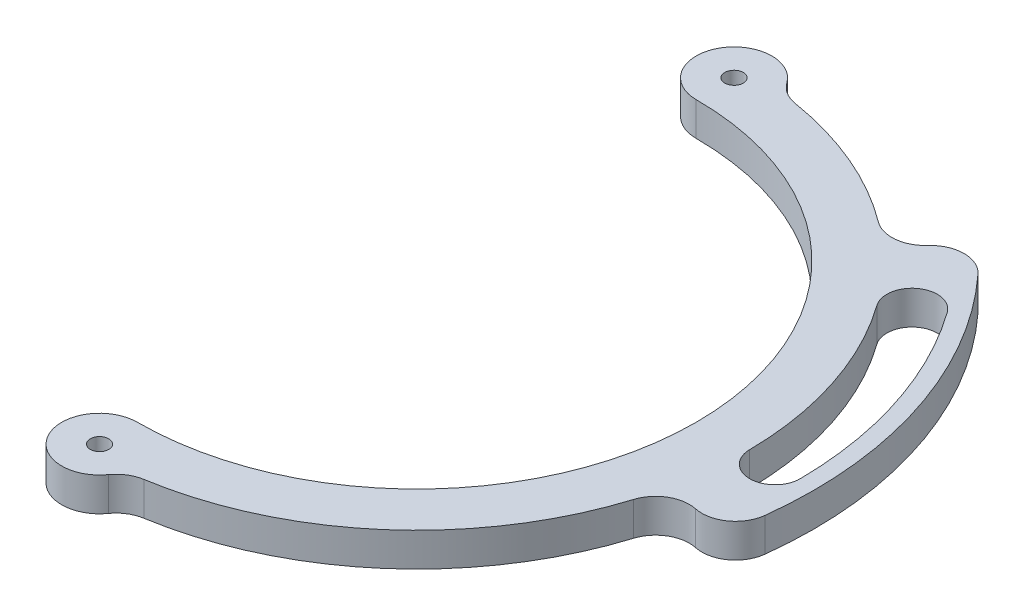
ISO-10303-21;
HEADER;
FILE_DESCRIPTION(('STEP AP214'),'2;1');
FILE_NAME('part.step','',(''),(''),'','','');
FILE_SCHEMA(('AUTOMOTIVE_DESIGN { 1 0 10303 214 1 1 1 1 }'));
ENDSEC;
DATA;
#1=APPLICATION_CONTEXT('core data for automotive mechanical design processes');
#2=APPLICATION_PROTOCOL_DEFINITION('international standard','automotive_design',2000,#1);
#3=PRODUCT_CONTEXT('',#1,'mechanical');
#4=PRODUCT('Part','Part','',(#3));
#5=PRODUCT_RELATED_PRODUCT_CATEGORY('part','',(#4));
#6=PRODUCT_DEFINITION_FORMATION('','',#4);
#7=PRODUCT_DEFINITION_CONTEXT('part definition',#1,'design');
#8=PRODUCT_DEFINITION('design','',#6,#7);
#9=PRODUCT_DEFINITION_SHAPE('','',#8);
#10=(LENGTH_UNIT() NAMED_UNIT(*) SI_UNIT(.MILLI.,.METRE.));
#11=(NAMED_UNIT(*) PLANE_ANGLE_UNIT() SI_UNIT($,.RADIAN.));
#12=(NAMED_UNIT(*) SI_UNIT($,.STERADIAN.) SOLID_ANGLE_UNIT());
#13=UNCERTAINTY_MEASURE_WITH_UNIT(LENGTH_MEASURE(1.E-05),#10,'distance_accuracy_value','');
#14=(GEOMETRIC_REPRESENTATION_CONTEXT(3) GLOBAL_UNCERTAINTY_ASSIGNED_CONTEXT((#13)) GLOBAL_UNIT_ASSIGNED_CONTEXT((#10,
#11,#12)) REPRESENTATION_CONTEXT('',''));
#15=CARTESIAN_POINT('',(0.,0.,0.));
#16=DIRECTION('',(0.,0.,1.));
#17=DIRECTION('',(1.,0.,0.));
#18=AXIS2_PLACEMENT_3D('',#15,#16,#17);
#19=CARTESIAN_POINT('',(0.,5.,0.));
#20=DIRECTION('',(0.,-1.,0.));
#21=DIRECTION('',(0.,0.,-1.));
#22=AXIS2_PLACEMENT_3D('',#19,#20,#21);
#23=CYLINDRICAL_SURFACE('',#22,98.0500000000001);
#24=CARTESIAN_POINT('',(0.,5.,0.));
#25=DIRECTION('',(0.,1.,0.));
#26=DIRECTION('',(0.,0.,1.));
#27=AXIS2_PLACEMENT_3D('',#24,#25,#26);
#28=CIRCLE('',#27,98.0500000000001);
#29=CARTESIAN_POINT('',(15.6870368600538,5.,96.7869793647437));
#30=VERTEX_POINT('',#29);
#31=CARTESIAN_POINT('',(93.6090485831535,5.,29.1744498381173));
#32=VERTEX_POINT('',#31);
#33=EDGE_CURVE('E171',#30,#32,#28,.T.);
#34=ORIENTED_EDGE('',*,*,#33,.F.);
#35=DIRECTION('',(0.,-1.,0.));
#36=VECTOR('',#35,1.);
#37=CARTESIAN_POINT('',(15.6870368600538,5.,96.7869793647437));
#38=LINE('',#37,#36);
#39=CARTESIAN_POINT('',(15.6870368600538,-5.,96.7869793647437));
#40=VERTEX_POINT('',#39);
#41=EDGE_CURVE('E226',#30,#40,#38,.T.);
#42=ORIENTED_EDGE('',*,*,#41,.T.);
#43=CARTESIAN_POINT('',(0.,-5.,0.));
#44=DIRECTION('',(0.,1.,0.));
#45=DIRECTION('',(0.,0.,1.));
#46=AXIS2_PLACEMENT_3D('',#43,#44,#45);
#47=CIRCLE('',#46,98.0500000000001);
#48=CARTESIAN_POINT('',(93.6090485831535,-5.,29.1744498381173));
#49=VERTEX_POINT('',#48);
#50=EDGE_CURVE('E201',#40,#49,#47,.T.);
#51=ORIENTED_EDGE('',*,*,#50,.T.);
#52=DIRECTION('',(0.,-1.,0.));
#53=VECTOR('',#52,1.);
#54=CARTESIAN_POINT('',(93.6090485831535,5.,29.1744498381173));
#55=LINE('',#54,#53);
#56=EDGE_CURVE('E219',#49,#32,#55,.F.);
#57=ORIENTED_EDGE('',*,*,#56,.T.);
#58=EDGE_LOOP('',(#34,#42,#51,#57));
#59=FACE_BOUND('',#58,.T.);
#60=ADVANCED_FACE('F35',(#59),#23,.T.);
#61=CARTESIAN_POINT('',(0.,5.,0.));
#62=DIRECTION('',(0.,-1.,0.));
#63=DIRECTION('',(0.,0.,-1.));
#64=AXIS2_PLACEMENT_3D('',#61,#62,#63);
#65=CYLINDRICAL_SURFACE('',#64,118.05);
#66=CARTESIAN_POINT('',(0.,5.,0.));
#67=DIRECTION('',(0.,1.,0.));
#68=DIRECTION('',(0.,0.,1.));
#69=AXIS2_PLACEMENT_3D('',#66,#67,#68);
#70=CIRCLE('',#69,118.05);
#71=CARTESIAN_POINT('',(86.7710710668279,5.,-80.0411377100266));
#72=VERTEX_POINT('',#71);
#73=CARTESIAN_POINT('',(117.246271435845,5.,13.7518847578128));
#74=VERTEX_POINT('',#73);
#75=EDGE_CURVE('E185',#72,#74,#70,.F.);
#76=ORIENTED_EDGE('',*,*,#75,.T.);
#77=DIRECTION('',(0.,-1.,0.));
#78=VECTOR('',#77,1.);
#79=CARTESIAN_POINT('',(117.246271435845,5.,13.7518847578128));
#80=LINE('',#79,#78);
#81=CARTESIAN_POINT('',(117.246271435845,-5.,13.7518847578128));
#82=VERTEX_POINT('',#81);
#83=EDGE_CURVE('E241',#74,#82,#80,.T.);
#84=ORIENTED_EDGE('',*,*,#83,.T.);
#85=CARTESIAN_POINT('',(0.,-5.,0.));
#86=DIRECTION('',(0.,1.,0.));
#87=DIRECTION('',(0.,0.,1.));
#88=AXIS2_PLACEMENT_3D('',#85,#86,#87);
#89=CIRCLE('',#88,118.05);
#90=CARTESIAN_POINT('',(86.7710710668279,-5.,-80.0411377100266));
#91=VERTEX_POINT('',#90);
#92=EDGE_CURVE('E207',#91,#82,#89,.F.);
#93=ORIENTED_EDGE('',*,*,#92,.F.);
#94=DIRECTION('',(0.,-1.,0.));
#95=VECTOR('',#94,1.);
#96=CARTESIAN_POINT('',(86.7710710668279,5.,-80.0411377100266));
#97=LINE('',#96,#95);
#98=EDGE_CURVE('E239',#91,#72,#97,.F.);
#99=ORIENTED_EDGE('',*,*,#98,.T.);
#100=EDGE_LOOP('',(#76,#84,#93,#99));
#101=FACE_BOUND('',#100,.T.);
#102=ADVANCED_FACE('F280',(#101),#65,.T.);
#103=CARTESIAN_POINT('',(58.582999772449,-5.,-78.6246439588839));
#104=VERTEX_POINT('',#103);
#105=CARTESIAN_POINT('',(15.6870368600538,-5.,-96.7869793647437));
#106=VERTEX_POINT('',#105);
#107=EDGE_CURVE('E200',#104,#106,#47,.T.);
#108=ORIENTED_EDGE('',*,*,#107,.T.);
#109=DIRECTION('',(0.,-1.,0.));
#110=VECTOR('',#109,1.);
#111=CARTESIAN_POINT('',(15.6870368600538,5.,-96.7869793647437));
#112=LINE('',#111,#110);
#113=CARTESIAN_POINT('',(15.6870368600538,5.,-96.7869793647437));
#114=VERTEX_POINT('',#113);
#115=EDGE_CURVE('E237',#106,#114,#112,.F.);
#116=ORIENTED_EDGE('',*,*,#115,.T.);
#117=CARTESIAN_POINT('',(58.582999772449,5.,-78.6246439588839));
#118=VERTEX_POINT('',#117);
#119=EDGE_CURVE('E170',#118,#114,#28,.T.);
#120=ORIENTED_EDGE('',*,*,#119,.F.);
#121=DIRECTION('',(0.,-1.,0.));
#122=VECTOR('',#121,1.);
#123=CARTESIAN_POINT('',(58.582999772449,5.,-78.6246439588839));
#124=LINE('',#123,#122);
#125=EDGE_CURVE('E234',#118,#104,#124,.T.);
#126=ORIENTED_EDGE('',*,*,#125,.T.);
#127=EDGE_LOOP('',(#108,#116,#120,#126));
#128=FACE_BOUND('',#127,.T.);
#129=ADVANCED_FACE('F293',(#128),#23,.T.);
#130=CARTESIAN_POINT('',(0.,5.,-94.3));
#131=DIRECTION('',(0.,-1.,0.));
#132=DIRECTION('',(0.,0.,-1.));
#133=AXIS2_PLACEMENT_3D('',#130,#131,#132);
#134=CYLINDRICAL_SURFACE('',#133,11.25);
#135=CARTESIAN_POINT('',(0.,5.,-94.3));
#136=DIRECTION('',(0.,1.,0.));
#137=DIRECTION('',(0.,0.,1.));
#138=AXIS2_PLACEMENT_3D('',#135,#136,#137);
#139=CIRCLE('',#138,11.25);
#140=CARTESIAN_POINT('',(9.15190868678004,5.,-100.842558168548));
#141=VERTEX_POINT('',#140);
#142=CARTESIAN_POINT('',(0.,5.,-83.05));
#143=VERTEX_POINT('',#142);
#144=EDGE_CURVE('E188',#141,#143,#139,.T.);
#145=ORIENTED_EDGE('',*,*,#144,.F.);
#146=DIRECTION('',(0.,-1.,0.));
#147=VECTOR('',#146,1.);
#148=CARTESIAN_POINT('',(9.15190868678004,5.,-100.842558168548));
#149=LINE('',#148,#147);
#150=CARTESIAN_POINT('',(9.15190868678004,-5.,-100.842558168548));
#151=VERTEX_POINT('',#150);
#152=EDGE_CURVE('E231',#141,#151,#149,.T.);
#153=ORIENTED_EDGE('',*,*,#152,.T.);
#154=CARTESIAN_POINT('',(0.,-5.,-94.3));
#155=DIRECTION('',(0.,1.,0.));
#156=DIRECTION('',(0.,0.,1.));
#157=AXIS2_PLACEMENT_3D('',#154,#155,#156);
#158=CIRCLE('',#157,11.25);
#159=CARTESIAN_POINT('',(0.,-5.,-83.05));
#160=VERTEX_POINT('',#159);
#161=EDGE_CURVE('E210',#151,#160,#158,.T.);
#162=ORIENTED_EDGE('',*,*,#161,.T.);
#163=DIRECTION('',(0.,-1.,0.));
#164=VECTOR('',#163,1.);
#165=CARTESIAN_POINT('',(0.,5.,-83.05));
#166=LINE('',#165,#164);
#167=EDGE_CURVE('E216',#143,#160,#166,.T.);
#168=ORIENTED_EDGE('',*,*,#167,.F.);
#169=EDGE_LOOP('',(#145,#153,#162,#168));
#170=FACE_BOUND('',#169,.T.);
#171=ADVANCED_FACE('F320',(#170),#134,.T.);
#172=CARTESIAN_POINT('',(0.,5.,0.));
#173=DIRECTION('',(0.,-1.,0.));
#174=DIRECTION('',(0.,0.,-1.));
#175=AXIS2_PLACEMENT_3D('',#172,#173,#174);
#176=CYLINDRICAL_SURFACE('',#175,83.05);
#177=CARTESIAN_POINT('',(0.,-5.,0.));
#178=DIRECTION('',(0.,1.,0.));
#179=DIRECTION('',(0.,0.,1.));
#180=AXIS2_PLACEMENT_3D('',#177,#178,#179);
#181=CIRCLE('',#180,83.05);
#182=CARTESIAN_POINT('',(0.,-5.,83.05));
#183=VERTEX_POINT('',#182);
#184=EDGE_CURVE('E177',#183,#160,#181,.T.);
#185=ORIENTED_EDGE('',*,*,#184,.F.);
#186=DIRECTION('',(0.,-1.,0.));
#187=VECTOR('',#186,1.);
#188=CARTESIAN_POINT('',(0.,5.,83.05));
#189=LINE('',#188,#187);
#190=CARTESIAN_POINT('',(0.,5.,83.05));
#191=VERTEX_POINT('',#190);
#192=EDGE_CURVE('E159',#191,#183,#189,.T.);
#193=ORIENTED_EDGE('',*,*,#192,.F.);
#194=CARTESIAN_POINT('',(0.,5.,0.));
#195=DIRECTION('',(0.,1.,0.));
#196=DIRECTION('',(0.,0.,1.));
#197=AXIS2_PLACEMENT_3D('',#194,#195,#196);
#198=CIRCLE('',#197,83.05);
#199=EDGE_CURVE('E190',#191,#143,#198,.T.);
#200=ORIENTED_EDGE('',*,*,#199,.T.);
#201=ORIENTED_EDGE('',*,*,#167,.T.);
#202=EDGE_LOOP('',(#185,#193,#200,#201));
#203=FACE_BOUND('',#202,.T.);
#204=ADVANCED_FACE('F315',(#203),#176,.F.);
#205=CARTESIAN_POINT('',(105.545980979423,5.,-0.921085821854197));
#206=DIRECTION('',(0.,-1.,0.));
#207=DIRECTION('',(0.,0.,-1.));
#208=AXIS2_PLACEMENT_3D('',#205,#206,#207);
#209=CYLINDRICAL_SURFACE('',#208,7.50000000000003);
#210=CARTESIAN_POINT('',(105.545980979423,-5.,-0.921085821854197));
#211=DIRECTION('',(0.,1.,0.));
#212=DIRECTION('',(0.,0.,1.));
#213=AXIS2_PLACEMENT_3D('',#210,#211,#212);
#214=CIRCLE('',#213,7.50000000000003);
#215=CARTESIAN_POINT('',(98.046266556442,-5.,-0.855636805616287));
#216=VERTEX_POINT('',#215);
#217=CARTESIAN_POINT('',(113.045695402405,-5.,-0.986534838092041));
#218=VERTEX_POINT('',#217);
#219=EDGE_CURVE('E155',#216,#218,#214,.T.);
#220=ORIENTED_EDGE('',*,*,#219,.F.);
#221=DIRECTION('',(0.,-1.,0.));
#222=VECTOR('',#221,1.);
#223=CARTESIAN_POINT('',(98.046266556442,5.,-0.855636805616287));
#224=LINE('',#223,#222);
#225=CARTESIAN_POINT('',(98.046266556442,5.,-0.855636805616287));
#226=VERTEX_POINT('',#225);
#227=EDGE_CURVE('E148',#226,#216,#224,.T.);
#228=ORIENTED_EDGE('',*,*,#227,.F.);
#229=CARTESIAN_POINT('',(105.545980979423,5.,-0.921085821854197));
#230=DIRECTION('',(0.,1.,0.));
#231=DIRECTION('',(0.,0.,1.));
#232=AXIS2_PLACEMENT_3D('',#229,#230,#231);
#233=CIRCLE('',#232,7.50000000000003);
#234=CARTESIAN_POINT('',(113.045695402405,5.,-0.986534838092041));
#235=VERTEX_POINT('',#234);
#236=EDGE_CURVE('E152',#226,#235,#233,.T.);
#237=ORIENTED_EDGE('',*,*,#236,.T.);
#238=DIRECTION('',(0.,-1.,0.));
#239=VECTOR('',#238,1.);
#240=CARTESIAN_POINT('',(113.045695402405,5.,-0.986534838092041));
#241=LINE('',#240,#239);
#242=EDGE_CURVE('E195',#235,#218,#241,.T.);
#243=ORIENTED_EDGE('',*,*,#242,.T.);
#244=EDGE_LOOP('',(#220,#228,#237,#243));
#245=FACE_BOUND('',#244,.T.);
#246=ADVANCED_FACE('F150',(#245),#209,.F.);
#247=CARTESIAN_POINT('',(79.8240265748373,-5.,-56.9379248074574));
#248=VERTEX_POINT('',#247);
#249=EDGE_CURVE('E197',#216,#248,#47,.T.);
#250=ORIENTED_EDGE('',*,*,#249,.T.);
#251=DIRECTION('',(0.,-1.,0.));
#252=VECTOR('',#251,1.);
#253=CARTESIAN_POINT('',(79.8240265748373,5.,-56.9379248074574));
#254=LINE('',#253,#252);
#255=CARTESIAN_POINT('',(79.8240265748373,5.,-56.9379248074574));
#256=VERTEX_POINT('',#255);
#257=EDGE_CURVE('E160',#256,#248,#254,.T.);
#258=ORIENTED_EDGE('',*,*,#257,.F.);
#259=EDGE_CURVE('E163',#226,#256,#28,.T.);
#260=ORIENTED_EDGE('',*,*,#259,.F.);
#261=ORIENTED_EDGE('',*,*,#227,.T.);
#262=EDGE_LOOP('',(#250,#258,#260,#261));
#263=FACE_BOUND('',#262,.T.);
#264=ADVANCED_FACE('F164',(#263),#23,.T.);
#265=CARTESIAN_POINT('',(85.9298929625094,5.,-61.2931969752892));
#266=DIRECTION('',(0.,-1.,0.));
#267=DIRECTION('',(0.,0.,-1.));
#268=AXIS2_PLACEMENT_3D('',#265,#266,#267);
#269=CYLINDRICAL_SURFACE('',#268,7.50000000000003);
#270=CARTESIAN_POINT('',(85.9298929625094,-5.,-61.2931969752892));
#271=DIRECTION('',(0.,1.,0.));
#272=DIRECTION('',(0.,0.,1.));
#273=AXIS2_PLACEMENT_3D('',#270,#271,#272);
#274=CIRCLE('',#273,7.50000000000003);
#275=CARTESIAN_POINT('',(92.0357593501821,-5.,-65.6484691431214));
#276=VERTEX_POINT('',#275);
#277=EDGE_CURVE('E199',#276,#248,#274,.T.);
#278=ORIENTED_EDGE('',*,*,#277,.F.);
#279=DIRECTION('',(0.,-1.,0.));
#280=VECTOR('',#279,1.);
#281=CARTESIAN_POINT('',(92.0357593501821,5.,-65.6484691431214));
#282=LINE('',#281,#280);
#283=CARTESIAN_POINT('',(92.0357593501821,5.,-65.6484691431214));
#284=VERTEX_POINT('',#283);
#285=EDGE_CURVE('E221',#284,#276,#282,.T.);
#286=ORIENTED_EDGE('',*,*,#285,.F.);
#287=CARTESIAN_POINT('',(85.9298929625094,5.,-61.2931969752892));
#288=DIRECTION('',(0.,1.,0.));
#289=DIRECTION('',(0.,0.,1.));
#290=AXIS2_PLACEMENT_3D('',#287,#288,#289);
#291=CIRCLE('',#290,7.50000000000003);
#292=EDGE_CURVE('E168',#284,#256,#291,.T.);
#293=ORIENTED_EDGE('',*,*,#292,.T.);
#294=ORIENTED_EDGE('',*,*,#257,.T.);
#295=EDGE_LOOP('',(#278,#286,#293,#294));
#296=FACE_BOUND('',#295,.T.);
#297=ADVANCED_FACE('F343',(#296),#269,.F.);
#298=CARTESIAN_POINT('',(-2.4980018054066E-13,5.,2.22044604925031E-13));
#299=DIRECTION('',(0.,-1.,0.));
#300=DIRECTION('',(0.,0.,-1.));
#301=AXIS2_PLACEMENT_3D('',#298,#299,#300);
#302=CYLINDRICAL_SURFACE('',#301,113.05);
#303=CARTESIAN_POINT('',(-2.4980018054066E-13,-5.,2.22044604925031E-13));
#304=DIRECTION('',(0.,1.,0.));
#305=DIRECTION('',(0.,0.,1.));
#306=AXIS2_PLACEMENT_3D('',#303,#304,#305);
#307=CIRCLE('',#306,113.05);
#308=EDGE_CURVE('E204',#218,#276,#307,.T.);
#309=ORIENTED_EDGE('',*,*,#308,.F.);
#310=ORIENTED_EDGE('',*,*,#242,.F.);
#311=CARTESIAN_POINT('',(-2.4980018054066E-13,5.,2.22044604925031E-13));
#312=DIRECTION('',(0.,1.,0.));
#313=DIRECTION('',(0.,0.,1.));
#314=AXIS2_PLACEMENT_3D('',#311,#312,#313);
#315=CIRCLE('',#314,113.05);
#316=EDGE_CURVE('E174',#235,#284,#315,.T.);
#317=ORIENTED_EDGE('',*,*,#316,.T.);
#318=ORIENTED_EDGE('',*,*,#285,.T.);
#319=EDGE_LOOP('',(#309,#310,#317,#318));
#320=FACE_BOUND('',#319,.T.);
#321=ADVANCED_FACE('F348',(#320),#302,.F.);
#322=CARTESIAN_POINT('',(0.,5.,94.3));
#323=DIRECTION('',(0.,-1.,0.));
#324=DIRECTION('',(0.,0.,-1.));
#325=AXIS2_PLACEMENT_3D('',#322,#323,#324);
#326=CYLINDRICAL_SURFACE('',#325,11.25);
#327=CARTESIAN_POINT('',(0.,-5.,94.3));
#328=DIRECTION('',(0.,1.,0.));
#329=DIRECTION('',(0.,0.,1.));
#330=AXIS2_PLACEMENT_3D('',#327,#328,#329);
#331=CIRCLE('',#330,11.25);
#332=CARTESIAN_POINT('',(9.15190868678003,-5.,100.842558168548));
#333=VERTEX_POINT('',#332);
#334=EDGE_CURVE('E175',#333,#183,#331,.F.);
#335=ORIENTED_EDGE('',*,*,#334,.F.);
#336=DIRECTION('',(0.,-1.,0.));
#337=VECTOR('',#336,1.);
#338=CARTESIAN_POINT('',(9.15190868678003,5.,100.842558168548));
#339=LINE('',#338,#337);
#340=CARTESIAN_POINT('',(9.15190868678003,5.,100.842558168548));
#341=VERTEX_POINT('',#340);
#342=EDGE_CURVE('E229',#333,#341,#339,.F.);
#343=ORIENTED_EDGE('',*,*,#342,.T.);
#344=CARTESIAN_POINT('',(0.,5.,94.3));
#345=DIRECTION('',(0.,1.,0.));
#346=DIRECTION('',(0.,0.,1.));
#347=AXIS2_PLACEMENT_3D('',#344,#345,#346);
#348=CIRCLE('',#347,11.25);
#349=EDGE_CURVE('E193',#341,#191,#348,.F.);
#350=ORIENTED_EDGE('',*,*,#349,.T.);
#351=ORIENTED_EDGE('',*,*,#192,.T.);
#352=EDGE_LOOP('',(#335,#343,#350,#351));
#353=FACE_BOUND('',#352,.T.);
#354=ADVANCED_FACE('F310',(#353),#326,.T.);
#355=CARTESIAN_POINT('',(0.,5.,0.));
#356=DIRECTION('',(0.,1.,0.));
#357=DIRECTION('',(0.,0.,1.));
#358=AXIS2_PLACEMENT_3D('',#355,#356,#357);
#359=PLANE('',#358);
#360=CARTESIAN_POINT('',(0.,5.,94.2999999999999));
#361=DIRECTION('',(0.,1.,0.));
#362=DIRECTION('',(0.,0.,1.));
#363=AXIS2_PLACEMENT_3D('',#360,#361,#362);
#364=CIRCLE('',#363,2.74999999999999);
#365=CARTESIAN_POINT('',(0.,5.,97.0499999999999));
#366=VERTEX_POINT('',#365);
#367=EDGE_CURVE('E264',#366,#366,#364,.T.);
#368=ORIENTED_EDGE('',*,*,#367,.F.);
#369=EDGE_LOOP('',(#368));
#370=FACE_BOUND('',#369,.T.);
#371=CARTESIAN_POINT('',(0.,5.,-94.3));
#372=DIRECTION('',(0.,1.,0.));
#373=DIRECTION('',(0.,0.,1.));
#374=AXIS2_PLACEMENT_3D('',#371,#372,#373);
#375=CIRCLE('',#374,2.74999999999999);
#376=CARTESIAN_POINT('',(0.,5.,-91.55));
#377=VERTEX_POINT('',#376);
#378=EDGE_CURVE('E536',#377,#377,#375,.T.);
#379=ORIENTED_EDGE('',*,*,#378,.F.);
#380=EDGE_LOOP('',(#379));
#381=FACE_BOUND('',#380,.T.);
#382=ORIENTED_EDGE('',*,*,#236,.F.);
#383=ORIENTED_EDGE('',*,*,#259,.T.);
#384=ORIENTED_EDGE('',*,*,#292,.F.);
#385=ORIENTED_EDGE('',*,*,#316,.F.);
#386=EDGE_LOOP('',(#382,#383,#384,#385));
#387=FACE_BOUND('',#386,.T.);
#388=ORIENTED_EDGE('',*,*,#33,.T.);
#389=CARTESIAN_POINT('',(103.15612136063,5.,32.1499164202812));
#390=DIRECTION('',(0.,1.,0.));
#391=DIRECTION('',(0.,0.,1.));
#392=AXIS2_PLACEMENT_3D('',#389,#390,#391);
#393=CIRCLE('',#392,10.);
#394=CARTESIAN_POINT('',(105.235238268807,5.,22.3684404129431));
#395=VERTEX_POINT('',#394);
#396=EDGE_CURVE('E11',#32,#395,#393,.F.);
#397=ORIENTED_EDGE('',*,*,#396,.T.);
#398=CARTESIAN_POINT('',(107.314355176984,5.,12.586964405605));
#399=DIRECTION('',(0.,1.,0.));
#400=DIRECTION('',(0.,0.,1.));
#401=AXIS2_PLACEMENT_3D('',#398,#399,#400);
#402=CIRCLE('',#401,10.);
#403=EDGE_CURVE('E248',#395,#74,#402,.T.);
#404=ORIENTED_EDGE('',*,*,#403,.T.);
#405=ORIENTED_EDGE('',*,*,#75,.F.);
#406=CARTESIAN_POINT('',(79.4207050298242,5.,-73.2608634440353));
#407=DIRECTION('',(0.,1.,0.));
#408=DIRECTION('',(0.,0.,1.));
#409=AXIS2_PLACEMENT_3D('',#406,#407,#408);
#410=CIRCLE('',#409,10.);
#411=CARTESIAN_POINT('',(71.9892567750503,5.,-79.9521695076239));
#412=VERTEX_POINT('',#411);
#413=EDGE_CURVE('E52',#72,#412,#410,.T.);
#414=ORIENTED_EDGE('',*,*,#413,.T.);
#415=CARTESIAN_POINT('',(64.5578085202765,5.,-86.6434755712127));
#416=DIRECTION('',(0.,1.,0.));
#417=DIRECTION('',(0.,0.,1.));
#418=AXIS2_PLACEMENT_3D('',#415,#416,#417);
#419=CIRCLE('',#418,10.);
#420=EDGE_CURVE('E260',#412,#118,#419,.F.);
#421=ORIENTED_EDGE('',*,*,#420,.T.);
#422=ORIENTED_EDGE('',*,*,#119,.T.);
#423=CARTESIAN_POINT('',(17.2869386305845,5.,-106.65816542948));
#424=DIRECTION('',(0.,1.,0.));
#425=DIRECTION('',(0.,0.,1.));
#426=AXIS2_PLACEMENT_3D('',#423,#424,#425);
#427=CIRCLE('',#426,10.);
#428=EDGE_CURVE('E256',#114,#141,#427,.F.);
#429=ORIENTED_EDGE('',*,*,#428,.T.);
#430=ORIENTED_EDGE('',*,*,#144,.T.);
#431=ORIENTED_EDGE('',*,*,#199,.F.);
#432=ORIENTED_EDGE('',*,*,#349,.F.);
#433=CARTESIAN_POINT('',(17.2869386305845,5.,106.65816542948));
#434=DIRECTION('',(0.,1.,0.));
#435=DIRECTION('',(0.,0.,1.));
#436=AXIS2_PLACEMENT_3D('',#433,#434,#435);
#437=CIRCLE('',#436,10.);
#438=EDGE_CURVE('E252',#341,#30,#437,.F.);
#439=ORIENTED_EDGE('',*,*,#438,.T.);
#440=EDGE_LOOP('',(#388,#397,#404,#405,#414,#421,#422,#429,#430,#431,#432,#439));
#441=FACE_BOUND('',#440,.T.);
#442=ADVANCED_FACE('F172',(#370,#381,#387,#441),#359,.T.);
#443=CARTESIAN_POINT('',(0.,-5.,0.));
#444=DIRECTION('',(0.,1.,0.));
#445=DIRECTION('',(0.,0.,1.));
#446=AXIS2_PLACEMENT_3D('',#443,#444,#445);
#447=PLANE('',#446);
#448=CARTESIAN_POINT('',(0.,-5.,94.2999999999999));
#449=DIRECTION('',(0.,1.,0.));
#450=DIRECTION('',(0.,0.,1.));
#451=AXIS2_PLACEMENT_3D('',#448,#449,#450);
#452=CIRCLE('',#451,2.75);
#453=CARTESIAN_POINT('',(0.,-5.,97.0499999999999));
#454=VERTEX_POINT('',#453);
#455=EDGE_CURVE('E268',#454,#454,#452,.T.);
#456=ORIENTED_EDGE('',*,*,#455,.T.);
#457=EDGE_LOOP('',(#456));
#458=FACE_BOUND('',#457,.T.);
#459=CARTESIAN_POINT('',(0.,-5.,-94.3));
#460=DIRECTION('',(0.,1.,0.));
#461=DIRECTION('',(0.,0.,1.));
#462=AXIS2_PLACEMENT_3D('',#459,#460,#461);
#463=CIRCLE('',#462,2.75);
#464=CARTESIAN_POINT('',(0.,-5.,-91.55));
#465=VERTEX_POINT('',#464);
#466=EDGE_CURVE('E180',#465,#465,#463,.T.);
#467=ORIENTED_EDGE('',*,*,#466,.T.);
#468=EDGE_LOOP('',(#467));
#469=FACE_BOUND('',#468,.T.);
#470=ORIENTED_EDGE('',*,*,#219,.T.);
#471=ORIENTED_EDGE('',*,*,#308,.T.);
#472=ORIENTED_EDGE('',*,*,#277,.T.);
#473=ORIENTED_EDGE('',*,*,#249,.F.);
#474=EDGE_LOOP('',(#470,#471,#472,#473));
#475=FACE_BOUND('',#474,.T.);
#476=ORIENTED_EDGE('',*,*,#92,.T.);
#477=CARTESIAN_POINT('',(107.314355176984,-5.,12.586964405605));
#478=DIRECTION('',(0.,1.,0.));
#479=DIRECTION('',(0.,0.,1.));
#480=AXIS2_PLACEMENT_3D('',#477,#478,#479);
#481=CIRCLE('',#480,10.);
#482=CARTESIAN_POINT('',(105.235238268807,-5.,22.3684404129431));
#483=VERTEX_POINT('',#482);
#484=EDGE_CURVE('E245',#82,#483,#481,.F.);
#485=ORIENTED_EDGE('',*,*,#484,.T.);
#486=CARTESIAN_POINT('',(103.15612136063,-5.,32.1499164202812));
#487=DIRECTION('',(0.,1.,0.));
#488=DIRECTION('',(0.,0.,1.));
#489=AXIS2_PLACEMENT_3D('',#486,#487,#488);
#490=CIRCLE('',#489,10.);
#491=EDGE_CURVE('E44',#483,#49,#490,.T.);
#492=ORIENTED_EDGE('',*,*,#491,.T.);
#493=ORIENTED_EDGE('',*,*,#50,.F.);
#494=CARTESIAN_POINT('',(17.2869386305845,-5.,106.65816542948));
#495=DIRECTION('',(0.,1.,0.));
#496=DIRECTION('',(0.,0.,1.));
#497=AXIS2_PLACEMENT_3D('',#494,#495,#496);
#498=CIRCLE('',#497,10.);
#499=EDGE_CURVE('E250',#40,#333,#498,.T.);
#500=ORIENTED_EDGE('',*,*,#499,.T.);
#501=ORIENTED_EDGE('',*,*,#334,.T.);
#502=ORIENTED_EDGE('',*,*,#184,.T.);
#503=ORIENTED_EDGE('',*,*,#161,.F.);
#504=CARTESIAN_POINT('',(17.2869386305845,-5.,-106.65816542948));
#505=DIRECTION('',(0.,1.,0.));
#506=DIRECTION('',(0.,0.,1.));
#507=AXIS2_PLACEMENT_3D('',#504,#505,#506);
#508=CIRCLE('',#507,10.);
#509=EDGE_CURVE('E254',#151,#106,#508,.T.);
#510=ORIENTED_EDGE('',*,*,#509,.T.);
#511=ORIENTED_EDGE('',*,*,#107,.F.);
#512=CARTESIAN_POINT('',(64.5578085202765,-5.,-86.6434755712127));
#513=DIRECTION('',(0.,1.,0.));
#514=DIRECTION('',(0.,0.,1.));
#515=AXIS2_PLACEMENT_3D('',#512,#513,#514);
#516=CIRCLE('',#515,10.);
#517=CARTESIAN_POINT('',(71.9892567750503,-5.,-79.9521695076239));
#518=VERTEX_POINT('',#517);
#519=EDGE_CURVE('E258',#104,#518,#516,.T.);
#520=ORIENTED_EDGE('',*,*,#519,.T.);
#521=CARTESIAN_POINT('',(79.4207050298242,-5.,-73.2608634440353));
#522=DIRECTION('',(0.,1.,0.));
#523=DIRECTION('',(0.,0.,1.));
#524=AXIS2_PLACEMENT_3D('',#521,#522,#523);
#525=CIRCLE('',#524,10.);
#526=EDGE_CURVE('E243',#518,#91,#525,.F.);
#527=ORIENTED_EDGE('',*,*,#526,.T.);
#528=EDGE_LOOP('',(#476,#485,#492,#493,#500,#501,#502,#503,#510,#511,#520,#527));
#529=FACE_BOUND('',#528,.T.);
#530=ADVANCED_FACE('F308',(#458,#469,#475,#529),#447,.F.);
#531=CARTESIAN_POINT('',(0.,5.,-94.3));
#532=DIRECTION('',(0.,1.,0.));
#533=DIRECTION('',(0.,0.,1.));
#534=AXIS2_PLACEMENT_3D('',#531,#532,#533);
#535=CYLINDRICAL_SURFACE('',#534,2.74999999999999);
#536=ORIENTED_EDGE('',*,*,#466,.F.);
#537=EDGE_LOOP('',(#536));
#538=FACE_BOUND('',#537,.T.);
#539=ORIENTED_EDGE('',*,*,#378,.T.);
#540=EDGE_LOOP('',(#539));
#541=FACE_BOUND('',#540,.T.);
#542=ADVANCED_FACE('F367',(#538,#541),#535,.F.);
#543=CARTESIAN_POINT('',(0.,5.,94.2999999999999));
#544=DIRECTION('',(0.,1.,0.));
#545=DIRECTION('',(0.,0.,1.));
#546=AXIS2_PLACEMENT_3D('',#543,#544,#545);
#547=CYLINDRICAL_SURFACE('',#546,2.74999999999999);
#548=ORIENTED_EDGE('',*,*,#455,.F.);
#549=EDGE_LOOP('',(#548));
#550=FACE_BOUND('',#549,.T.);
#551=ORIENTED_EDGE('',*,*,#367,.T.);
#552=EDGE_LOOP('',(#551));
#553=FACE_BOUND('',#552,.T.);
#554=ADVANCED_FACE('F331',(#550,#553),#547,.F.);
#555=CARTESIAN_POINT('',(17.2869386305845,5.,106.65816542948));
#556=DIRECTION('',(0.,1.,0.));
#557=DIRECTION('',(0.,0.,1.));
#558=AXIS2_PLACEMENT_3D('',#555,#556,#557);
#559=CYLINDRICAL_SURFACE('',#558,10.);
#560=ORIENTED_EDGE('',*,*,#438,.F.);
#561=ORIENTED_EDGE('',*,*,#342,.F.);
#562=ORIENTED_EDGE('',*,*,#499,.F.);
#563=ORIENTED_EDGE('',*,*,#41,.F.);
#564=EDGE_LOOP('',(#560,#561,#562,#563));
#565=FACE_BOUND('',#564,.T.);
#566=ADVANCED_FACE('F304',(#565),#559,.F.);
#567=CARTESIAN_POINT('',(17.2869386305845,5.,-106.65816542948));
#568=DIRECTION('',(0.,1.,0.));
#569=DIRECTION('',(0.,0.,1.));
#570=AXIS2_PLACEMENT_3D('',#567,#568,#569);
#571=CYLINDRICAL_SURFACE('',#570,10.);
#572=ORIENTED_EDGE('',*,*,#428,.F.);
#573=ORIENTED_EDGE('',*,*,#115,.F.);
#574=ORIENTED_EDGE('',*,*,#509,.F.);
#575=ORIENTED_EDGE('',*,*,#152,.F.);
#576=EDGE_LOOP('',(#572,#573,#574,#575));
#577=FACE_BOUND('',#576,.T.);
#578=ADVANCED_FACE('F323',(#577),#571,.F.);
#579=CARTESIAN_POINT('',(79.4207050298242,5.,-73.2608634440353));
#580=DIRECTION('',(0.,-1.,0.));
#581=DIRECTION('',(0.,0.,-1.));
#582=AXIS2_PLACEMENT_3D('',#579,#580,#581);
#583=CYLINDRICAL_SURFACE('',#582,10.);
#584=DIRECTION('',(0.,1.,0.));
#585=VECTOR('',#584,1.);
#586=CARTESIAN_POINT('',(71.9892567750503,-5.,-79.9521695076239));
#587=LINE('',#586,#585);
#588=EDGE_CURVE('E262',#412,#518,#587,.F.);
#589=ORIENTED_EDGE('',*,*,#588,.F.);
#590=ORIENTED_EDGE('',*,*,#413,.F.);
#591=ORIENTED_EDGE('',*,*,#98,.F.);
#592=ORIENTED_EDGE('',*,*,#526,.F.);
#593=EDGE_LOOP('',(#589,#590,#591,#592));
#594=FACE_BOUND('',#593,.T.);
#595=ADVANCED_FACE('F285',(#594),#583,.T.);
#596=CARTESIAN_POINT('',(64.5578085202765,5.,-86.6434755712127));
#597=DIRECTION('',(0.,-1.,0.));
#598=DIRECTION('',(0.,0.,-1.));
#599=AXIS2_PLACEMENT_3D('',#596,#597,#598);
#600=CYLINDRICAL_SURFACE('',#599,10.);
#601=ORIENTED_EDGE('',*,*,#420,.F.);
#602=ORIENTED_EDGE('',*,*,#588,.T.);
#603=ORIENTED_EDGE('',*,*,#519,.F.);
#604=ORIENTED_EDGE('',*,*,#125,.F.);
#605=EDGE_LOOP('',(#601,#602,#603,#604));
#606=FACE_BOUND('',#605,.T.);
#607=ADVANCED_FACE('F287',(#606),#600,.F.);
#608=CARTESIAN_POINT('',(107.314355176984,5.,12.586964405605));
#609=DIRECTION('',(0.,-1.,0.));
#610=DIRECTION('',(0.,0.,-1.));
#611=AXIS2_PLACEMENT_3D('',#608,#609,#610);
#612=CYLINDRICAL_SURFACE('',#611,10.);
#613=ORIENTED_EDGE('',*,*,#83,.F.);
#614=ORIENTED_EDGE('',*,*,#403,.F.);
#615=DIRECTION('',(0.,-1.,0.));
#616=VECTOR('',#615,1.);
#617=CARTESIAN_POINT('',(105.235238268807,5.,22.3684404129431));
#618=LINE('',#617,#616);
#619=EDGE_CURVE('E39',#483,#395,#618,.F.);
#620=ORIENTED_EDGE('',*,*,#619,.F.);
#621=ORIENTED_EDGE('',*,*,#484,.F.);
#622=EDGE_LOOP('',(#613,#614,#620,#621));
#623=FACE_BOUND('',#622,.T.);
#624=ADVANCED_FACE('F37',(#623),#612,.T.);
#625=CARTESIAN_POINT('',(103.15612136063,5.,32.1499164202812));
#626=DIRECTION('',(0.,-1.,0.));
#627=DIRECTION('',(0.,0.,-1.));
#628=AXIS2_PLACEMENT_3D('',#625,#626,#627);
#629=CYLINDRICAL_SURFACE('',#628,10.);
#630=ORIENTED_EDGE('',*,*,#396,.F.);
#631=ORIENTED_EDGE('',*,*,#56,.F.);
#632=ORIENTED_EDGE('',*,*,#491,.F.);
#633=ORIENTED_EDGE('',*,*,#619,.T.);
#634=EDGE_LOOP('',(#630,#631,#632,#633));
#635=FACE_BOUND('',#634,.T.);
#636=ADVANCED_FACE('F274',(#635),#629,.F.);
#637=CLOSED_SHELL('',(#60,#102,#129,#171,#204,#246,#264,#297,#321,#354,#442,#530,#542,#554,#566,
#578,#595,#607,#624,#636));
#638=MANIFOLD_SOLID_BREP('B2',#637);
#639=ADVANCED_BREP_SHAPE_REPRESENTATION('',(#18,#638),#14);
#640=SHAPE_DEFINITION_REPRESENTATION(#9,#639);
ENDSEC;
END-ISO-10303-21;
